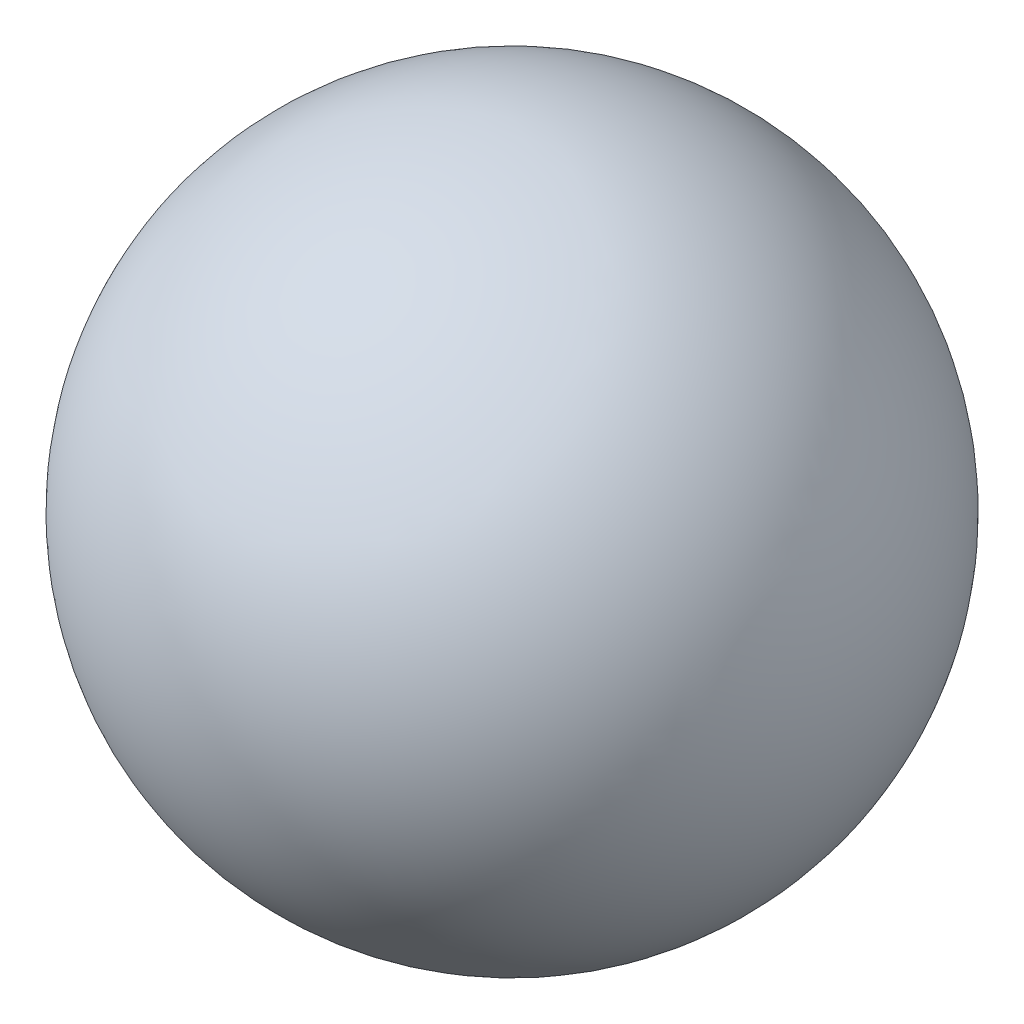
ISO-10303-21;
HEADER;
FILE_DESCRIPTION(('STEP AP214'),'2;1');
FILE_NAME('part.step','',(''),(''),'','','');
FILE_SCHEMA(('AUTOMOTIVE_DESIGN { 1 0 10303 214 1 1 1 1 }'));
ENDSEC;
DATA;
#1=APPLICATION_CONTEXT('core data for automotive mechanical design processes');
#2=APPLICATION_PROTOCOL_DEFINITION('international standard','automotive_design',2000,#1);
#3=PRODUCT_CONTEXT('',#1,'mechanical');
#4=PRODUCT('Part','Part','',(#3));
#5=PRODUCT_RELATED_PRODUCT_CATEGORY('part','',(#4));
#6=PRODUCT_DEFINITION_FORMATION('','',#4);
#7=PRODUCT_DEFINITION_CONTEXT('part definition',#1,'design');
#8=PRODUCT_DEFINITION('design','',#6,#7);
#9=PRODUCT_DEFINITION_SHAPE('','',#8);
#10=(LENGTH_UNIT() NAMED_UNIT(*) SI_UNIT(.MILLI.,.METRE.));
#11=(NAMED_UNIT(*) PLANE_ANGLE_UNIT() SI_UNIT($,.RADIAN.));
#12=(NAMED_UNIT(*) SI_UNIT($,.STERADIAN.) SOLID_ANGLE_UNIT());
#13=UNCERTAINTY_MEASURE_WITH_UNIT(LENGTH_MEASURE(1.E-05),#10,'distance_accuracy_value','');
#14=(GEOMETRIC_REPRESENTATION_CONTEXT(3) GLOBAL_UNCERTAINTY_ASSIGNED_CONTEXT((#13)) GLOBAL_UNIT_ASSIGNED_CONTEXT((#10,
#11,#12)) REPRESENTATION_CONTEXT('',''));
#15=CARTESIAN_POINT('',(0.,0.,0.));
#16=DIRECTION('',(0.,0.,1.));
#17=DIRECTION('',(1.,0.,0.));
#18=AXIS2_PLACEMENT_3D('',#15,#16,#17);
#19=CARTESIAN_POINT('',(2.5,4.76,0.));
#20=DIRECTION('',(1.,0.,0.));
#21=DIRECTION('',(0.,-1.,0.));
#22=AXIS2_PLACEMENT_3D('',#19,#20,#21);
#23=SPHERICAL_SURFACE('',#22,0.992);
#24=CARTESIAN_POINT('',(3.492,4.76,0.));
#25=VERTEX_POINT('',#24);
#26=VERTEX_LOOP('',#25);
#27=FACE_BOUND('',#26,.T.);
#28=ADVANCED_FACE('F30',(#27),#23,.T.);
#29=CLOSED_SHELL('',(#28));
#30=MANIFOLD_SOLID_BREP('B2',#29);
#31=ADVANCED_BREP_SHAPE_REPRESENTATION('',(#18,#30),#14);
#32=SHAPE_DEFINITION_REPRESENTATION(#9,#31);
ENDSEC;
END-ISO-10303-21;
